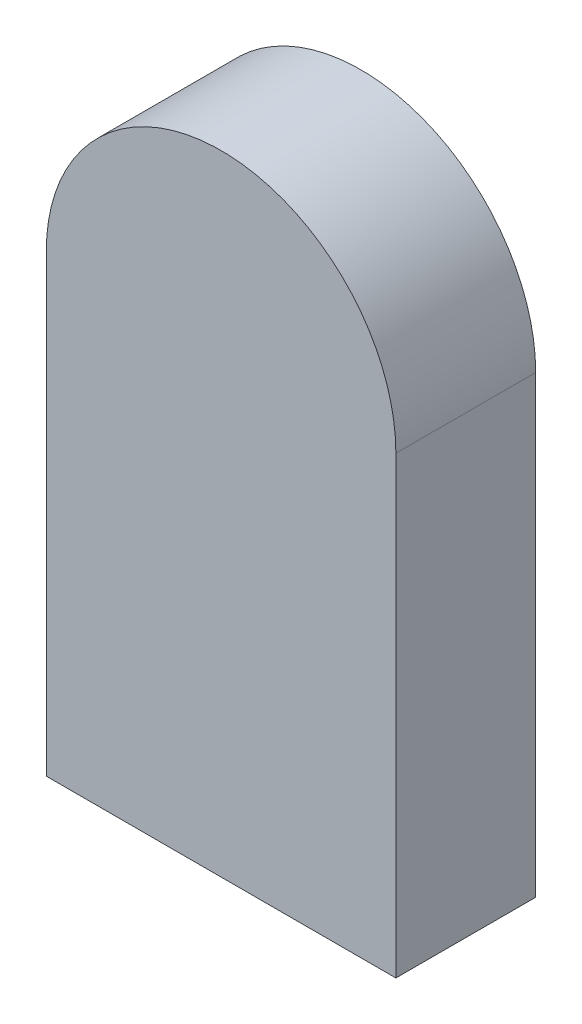
ISO-10303-21;
HEADER;
FILE_DESCRIPTION(('STEP AP214'),'2;1');
FILE_NAME('part.step','',(''),(''),'','','');
FILE_SCHEMA(('AUTOMOTIVE_DESIGN { 1 0 10303 214 1 1 1 1 }'));
ENDSEC;
DATA;
#1=APPLICATION_CONTEXT('core data for automotive mechanical design processes');
#2=APPLICATION_PROTOCOL_DEFINITION('international standard','automotive_design',2000,#1);
#3=PRODUCT_CONTEXT('',#1,'mechanical');
#4=PRODUCT('Part','Part','',(#3));
#5=PRODUCT_RELATED_PRODUCT_CATEGORY('part','',(#4));
#6=PRODUCT_DEFINITION_FORMATION('','',#4);
#7=PRODUCT_DEFINITION_CONTEXT('part definition',#1,'design');
#8=PRODUCT_DEFINITION('design','',#6,#7);
#9=PRODUCT_DEFINITION_SHAPE('','',#8);
#10=(LENGTH_UNIT() NAMED_UNIT(*) SI_UNIT(.MILLI.,.METRE.));
#11=(NAMED_UNIT(*) PLANE_ANGLE_UNIT() SI_UNIT($,.RADIAN.));
#12=(NAMED_UNIT(*) SI_UNIT($,.STERADIAN.) SOLID_ANGLE_UNIT());
#13=UNCERTAINTY_MEASURE_WITH_UNIT(LENGTH_MEASURE(1.E-05),#10,'distance_accuracy_value','');
#14=(GEOMETRIC_REPRESENTATION_CONTEXT(3) GLOBAL_UNCERTAINTY_ASSIGNED_CONTEXT((#13)) GLOBAL_UNIT_ASSIGNED_CONTEXT((#10,
#11,#12)) REPRESENTATION_CONTEXT('',''));
#15=CARTESIAN_POINT('',(0.,0.,0.));
#16=DIRECTION('',(0.,0.,1.));
#17=DIRECTION('',(1.,0.,0.));
#18=AXIS2_PLACEMENT_3D('',#15,#16,#17);
#19=CARTESIAN_POINT('',(1.125,-2.05,0.));
#20=DIRECTION('',(0.,1.,0.));
#21=DIRECTION('',(1.,0.,0.));
#22=AXIS2_PLACEMENT_3D('',#19,#20,#21);
#23=PLANE('',#22);
#24=DIRECTION('',(1.,0.,0.));
#25=VECTOR('',#24,1.);
#26=CARTESIAN_POINT('',(1.125,-2.05,0.));
#27=LINE('',#26,#25);
#28=CARTESIAN_POINT('',(1.125,-2.05,0.));
#29=VERTEX_POINT('',#28);
#30=CARTESIAN_POINT('',(1.375,-2.05,0.));
#31=VERTEX_POINT('',#30);
#32=EDGE_CURVE('E11',#29,#31,#27,.T.);
#33=ORIENTED_EDGE('',*,*,#32,.T.);
#34=DIRECTION('',(0.,0.,1.));
#35=VECTOR('',#34,1.);
#36=CARTESIAN_POINT('',(1.375,-2.05,0.));
#37=LINE('',#36,#35);
#38=CARTESIAN_POINT('',(1.375,-2.05,0.1));
#39=VERTEX_POINT('',#38);
#40=EDGE_CURVE('E24',#31,#39,#37,.T.);
#41=ORIENTED_EDGE('',*,*,#40,.T.);
#42=DIRECTION('',(1.,0.,0.));
#43=VECTOR('',#42,1.);
#44=CARTESIAN_POINT('',(1.125,-2.05,0.1));
#45=LINE('',#44,#43);
#46=CARTESIAN_POINT('',(1.125,-2.05,0.1));
#47=VERTEX_POINT('',#46);
#48=EDGE_CURVE('E87',#47,#39,#45,.T.);
#49=ORIENTED_EDGE('',*,*,#48,.F.);
#50=DIRECTION('',(0.,0.,1.));
#51=VECTOR('',#50,1.);
#52=CARTESIAN_POINT('',(1.125,-2.05,0.));
#53=LINE('',#52,#51);
#54=EDGE_CURVE('E36',#29,#47,#53,.T.);
#55=ORIENTED_EDGE('',*,*,#54,.F.);
#56=EDGE_LOOP('',(#33,#41,#49,#55));
#57=FACE_BOUND('',#56,.T.);
#58=ADVANCED_FACE('F17',(#57),#23,.F.);
#59=CARTESIAN_POINT('',(1.375,-2.05,0.));
#60=DIRECTION('',(-1.,0.,0.));
#61=DIRECTION('',(0.,1.,0.));
#62=AXIS2_PLACEMENT_3D('',#59,#60,#61);
#63=PLANE('',#62);
#64=DIRECTION('',(0.,1.,0.));
#65=VECTOR('',#64,1.);
#66=CARTESIAN_POINT('',(1.375,-2.05,0.));
#67=LINE('',#66,#65);
#68=CARTESIAN_POINT('',(1.375,-1.725,0.));
#69=VERTEX_POINT('',#68);
#70=EDGE_CURVE('E84',#31,#69,#67,.T.);
#71=ORIENTED_EDGE('',*,*,#70,.T.);
#72=DIRECTION('',(0.,0.,1.));
#73=VECTOR('',#72,1.);
#74=CARTESIAN_POINT('',(1.375,-1.725,0.));
#75=LINE('',#74,#73);
#76=CARTESIAN_POINT('',(1.375,-1.725,0.1));
#77=VERTEX_POINT('',#76);
#78=EDGE_CURVE('E82',#69,#77,#75,.T.);
#79=ORIENTED_EDGE('',*,*,#78,.T.);
#80=DIRECTION('',(0.,1.,0.));
#81=VECTOR('',#80,1.);
#82=CARTESIAN_POINT('',(1.375,-2.05,0.1));
#83=LINE('',#82,#81);
#84=EDGE_CURVE('E72',#39,#77,#83,.T.);
#85=ORIENTED_EDGE('',*,*,#84,.F.);
#86=ORIENTED_EDGE('',*,*,#40,.F.);
#87=EDGE_LOOP('',(#71,#79,#85,#86));
#88=FACE_BOUND('',#87,.T.);
#89=ADVANCED_FACE('F89',(#88),#63,.F.);
#90=CARTESIAN_POINT('',(1.25,-1.725,0.));
#91=DIRECTION('',(0.,0.,-1.));
#92=DIRECTION('',(1.,0.,0.));
#93=AXIS2_PLACEMENT_3D('',#90,#91,#92);
#94=CYLINDRICAL_SURFACE('',#93,0.125);
#95=CARTESIAN_POINT('',(1.25,-1.725,0.));
#96=DIRECTION('',(0.,0.,1.));
#97=DIRECTION('',(1.,0.,0.));
#98=AXIS2_PLACEMENT_3D('',#95,#96,#97);
#99=CIRCLE('',#98,0.125);
#100=CARTESIAN_POINT('',(1.125,-1.725,0.));
#101=VERTEX_POINT('',#100);
#102=EDGE_CURVE('E62',#69,#101,#99,.T.);
#103=ORIENTED_EDGE('',*,*,#102,.T.);
#104=DIRECTION('',(0.,0.,1.));
#105=VECTOR('',#104,1.);
#106=CARTESIAN_POINT('',(1.125,-1.725,0.));
#107=LINE('',#106,#105);
#108=CARTESIAN_POINT('',(1.125,-1.725,0.1));
#109=VERTEX_POINT('',#108);
#110=EDGE_CURVE('E57',#101,#109,#107,.T.);
#111=ORIENTED_EDGE('',*,*,#110,.T.);
#112=CARTESIAN_POINT('',(1.25,-1.725,0.1));
#113=DIRECTION('',(0.,0.,1.));
#114=DIRECTION('',(1.,0.,0.));
#115=AXIS2_PLACEMENT_3D('',#112,#113,#114);
#116=CIRCLE('',#115,0.125);
#117=EDGE_CURVE('E60',#77,#109,#116,.T.);
#118=ORIENTED_EDGE('',*,*,#117,.F.);
#119=ORIENTED_EDGE('',*,*,#78,.F.);
#120=EDGE_LOOP('',(#103,#111,#118,#119));
#121=FACE_BOUND('',#120,.T.);
#122=ADVANCED_FACE('F59',(#121),#94,.T.);
#123=CARTESIAN_POINT('',(1.125,-2.05,0.));
#124=DIRECTION('',(-1.,0.,0.));
#125=DIRECTION('',(0.,1.,0.));
#126=AXIS2_PLACEMENT_3D('',#123,#124,#125);
#127=PLANE('',#126);
#128=ORIENTED_EDGE('',*,*,#54,.T.);
#129=DIRECTION('',(0.,1.,0.));
#130=VECTOR('',#129,1.);
#131=CARTESIAN_POINT('',(1.125,-2.05,0.1));
#132=LINE('',#131,#130);
#133=EDGE_CURVE('E71',#47,#109,#132,.T.);
#134=ORIENTED_EDGE('',*,*,#133,.T.);
#135=ORIENTED_EDGE('',*,*,#110,.F.);
#136=DIRECTION('',(0.,1.,0.));
#137=VECTOR('',#136,1.);
#138=CARTESIAN_POINT('',(1.125,-2.05,0.));
#139=LINE('',#138,#137);
#140=EDGE_CURVE('E76',#29,#101,#139,.T.);
#141=ORIENTED_EDGE('',*,*,#140,.F.);
#142=EDGE_LOOP('',(#128,#134,#135,#141));
#143=FACE_BOUND('',#142,.T.);
#144=ADVANCED_FACE('F75',(#143),#127,.T.);
#145=CARTESIAN_POINT('',(1.25,-1.850342514613,0.));
#146=DIRECTION('',(0.,0.,1.));
#147=DIRECTION('',(1.,0.,0.));
#148=AXIS2_PLACEMENT_3D('',#145,#146,#147);
#149=PLANE('',#148);
#150=ORIENTED_EDGE('',*,*,#140,.T.);
#151=ORIENTED_EDGE('',*,*,#102,.F.);
#152=ORIENTED_EDGE('',*,*,#70,.F.);
#153=ORIENTED_EDGE('',*,*,#32,.F.);
#154=EDGE_LOOP('',(#150,#151,#152,#153));
#155=FACE_BOUND('',#154,.T.);
#156=ADVANCED_FACE('F91',(#155),#149,.F.);
#157=CARTESIAN_POINT('',(1.25,-1.850342514613,0.1));
#158=DIRECTION('',(0.,0.,1.));
#159=DIRECTION('',(1.,0.,0.));
#160=AXIS2_PLACEMENT_3D('',#157,#158,#159);
#161=PLANE('',#160);
#162=ORIENTED_EDGE('',*,*,#48,.T.);
#163=ORIENTED_EDGE('',*,*,#84,.T.);
#164=ORIENTED_EDGE('',*,*,#117,.T.);
#165=ORIENTED_EDGE('',*,*,#133,.F.);
#166=EDGE_LOOP('',(#162,#163,#164,#165));
#167=FACE_BOUND('',#166,.T.);
#168=ADVANCED_FACE('F70',(#167),#161,.T.);
#169=CLOSED_SHELL('',(#58,#89,#122,#144,#156,#168));
#170=MANIFOLD_SOLID_BREP('B1',#169);
#171=ADVANCED_BREP_SHAPE_REPRESENTATION('',(#18,#170),#14);
#172=SHAPE_DEFINITION_REPRESENTATION(#9,#171);
ENDSEC;
END-ISO-10303-21;
